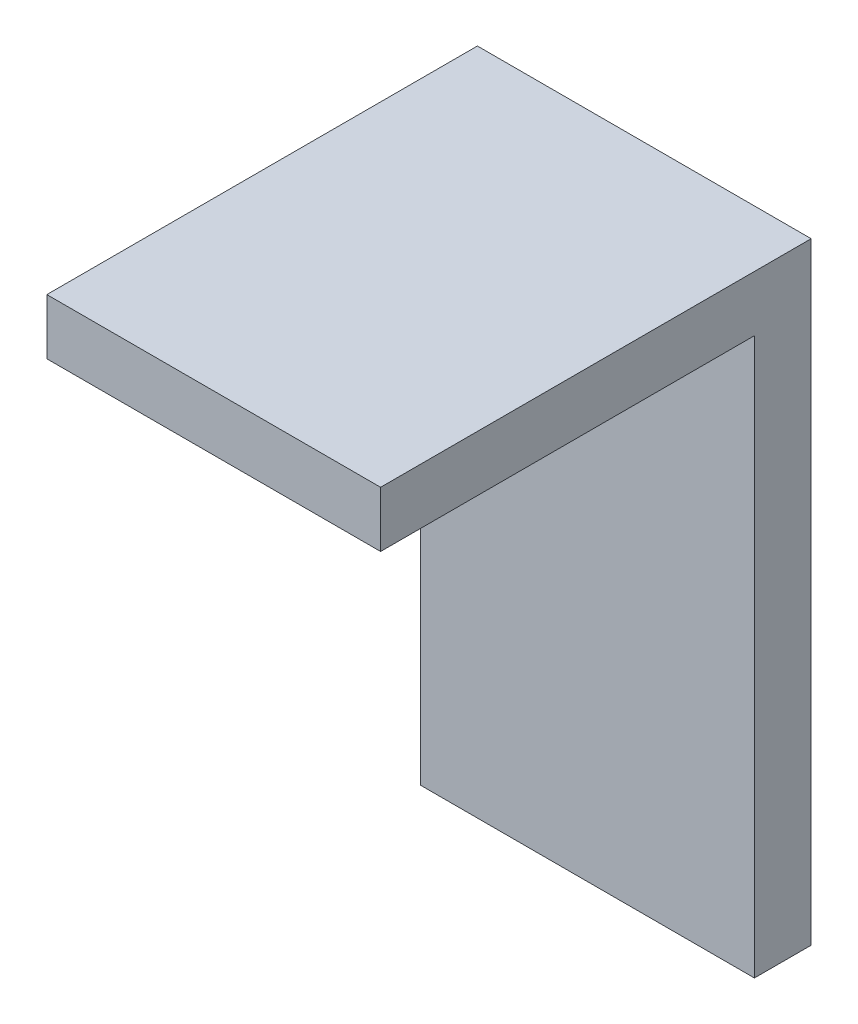
ISO-10303-21;
HEADER;
FILE_DESCRIPTION(('STEP AP214'),'2;1');
FILE_NAME('part.step','',(''),(''),'','','');
FILE_SCHEMA(('AUTOMOTIVE_DESIGN { 1 0 10303 214 1 1 1 1 }'));
ENDSEC;
DATA;
#1=APPLICATION_CONTEXT('core data for automotive mechanical design processes');
#2=APPLICATION_PROTOCOL_DEFINITION('international standard','automotive_design',2000,#1);
#3=PRODUCT_CONTEXT('',#1,'mechanical');
#4=PRODUCT('Part','Part','',(#3));
#5=PRODUCT_RELATED_PRODUCT_CATEGORY('part','',(#4));
#6=PRODUCT_DEFINITION_FORMATION('','',#4);
#7=PRODUCT_DEFINITION_CONTEXT('part definition',#1,'design');
#8=PRODUCT_DEFINITION('design','',#6,#7);
#9=PRODUCT_DEFINITION_SHAPE('','',#8);
#10=(LENGTH_UNIT() NAMED_UNIT(*) SI_UNIT(.MILLI.,.METRE.));
#11=(NAMED_UNIT(*) PLANE_ANGLE_UNIT() SI_UNIT($,.RADIAN.));
#12=(NAMED_UNIT(*) SI_UNIT($,.STERADIAN.) SOLID_ANGLE_UNIT());
#13=UNCERTAINTY_MEASURE_WITH_UNIT(LENGTH_MEASURE(1.E-05),#10,'distance_accuracy_value','');
#14=(GEOMETRIC_REPRESENTATION_CONTEXT(3) GLOBAL_UNCERTAINTY_ASSIGNED_CONTEXT((#13)) GLOBAL_UNIT_ASSIGNED_CONTEXT((#10,
#11,#12)) REPRESENTATION_CONTEXT('',''));
#15=CARTESIAN_POINT('',(0.,0.,0.));
#16=DIRECTION('',(0.,0.,1.));
#17=DIRECTION('',(1.,0.,0.));
#18=AXIS2_PLACEMENT_3D('',#15,#16,#17);
#19=CARTESIAN_POINT('',(-2.9,4.55,0.));
#20=DIRECTION('',(-1.,0.,0.));
#21=DIRECTION('',(0.,0.,1.));
#22=AXIS2_PLACEMENT_3D('',#19,#20,#21);
#23=PLANE('',#22);
#24=DIRECTION('',(0.,1.,0.));
#25=VECTOR('',#24,1.);
#26=CARTESIAN_POINT('',(-2.9,4.,0.));
#27=LINE('',#26,#25);
#28=CARTESIAN_POINT('',(-2.9,4.,0.));
#29=VERTEX_POINT('',#28);
#30=CARTESIAN_POINT('',(-2.9,4.55,0.));
#31=VERTEX_POINT('',#30);
#32=EDGE_CURVE('E11',#29,#31,#27,.T.);
#33=ORIENTED_EDGE('',*,*,#32,.F.);
#34=DIRECTION('',(0.,0.,-1.));
#35=VECTOR('',#34,1.);
#36=CARTESIAN_POINT('',(-2.9,4.,0.051));
#37=LINE('',#36,#35);
#38=CARTESIAN_POINT('',(-2.9,4.,0.051));
#39=VERTEX_POINT('',#38);
#40=EDGE_CURVE('E24',#39,#29,#37,.T.);
#41=ORIENTED_EDGE('',*,*,#40,.F.);
#42=DIRECTION('',(0.,-1.,0.));
#43=VECTOR('',#42,1.);
#44=CARTESIAN_POINT('',(-2.9,4.5,0.051));
#45=LINE('',#44,#43);
#46=CARTESIAN_POINT('',(-2.9,4.5,0.051));
#47=VERTEX_POINT('',#46);
#48=EDGE_CURVE('E87',#47,#39,#45,.T.);
#49=ORIENTED_EDGE('',*,*,#48,.F.);
#50=DIRECTION('',(0.,0.,-1.));
#51=VECTOR('',#50,1.);
#52=CARTESIAN_POINT('',(-2.9,4.5,0.387));
#53=LINE('',#52,#51);
#54=CARTESIAN_POINT('',(-2.9,4.5,0.387));
#55=VERTEX_POINT('',#54);
#56=EDGE_CURVE('E114',#55,#47,#53,.T.);
#57=ORIENTED_EDGE('',*,*,#56,.F.);
#58=DIRECTION('',(0.,-1.,0.));
#59=VECTOR('',#58,1.);
#60=CARTESIAN_POINT('',(-2.9,4.55,0.387));
#61=LINE('',#60,#59);
#62=CARTESIAN_POINT('',(-2.9,4.55,0.387));
#63=VERTEX_POINT('',#62);
#64=EDGE_CURVE('E111',#63,#55,#61,.T.);
#65=ORIENTED_EDGE('',*,*,#64,.F.);
#66=DIRECTION('',(0.,0.,1.));
#67=VECTOR('',#66,1.);
#68=CARTESIAN_POINT('',(-2.9,4.55,0.));
#69=LINE('',#68,#67);
#70=EDGE_CURVE('E108',#31,#63,#69,.T.);
#71=ORIENTED_EDGE('',*,*,#70,.F.);
#72=EDGE_LOOP('',(#33,#41,#49,#57,#65,#71));
#73=FACE_BOUND('',#72,.T.);
#74=ADVANCED_FACE('F17',(#73),#23,.T.);
#75=CARTESIAN_POINT('',(-2.6,4.,0.));
#76=DIRECTION('',(1.,0.,0.));
#77=DIRECTION('',(0.,0.,1.));
#78=AXIS2_PLACEMENT_3D('',#75,#76,#77);
#79=PLANE('',#78);
#80=DIRECTION('',(0.,-1.,0.));
#81=VECTOR('',#80,1.);
#82=CARTESIAN_POINT('',(-2.6,4.55,0.));
#83=LINE('',#82,#81);
#84=CARTESIAN_POINT('',(-2.6,4.55,0.));
#85=VERTEX_POINT('',#84);
#86=CARTESIAN_POINT('',(-2.6,4.,0.));
#87=VERTEX_POINT('',#86);
#88=EDGE_CURVE('E106',#85,#87,#83,.T.);
#89=ORIENTED_EDGE('',*,*,#88,.F.);
#90=DIRECTION('',(0.,0.,-1.));
#91=VECTOR('',#90,1.);
#92=CARTESIAN_POINT('',(-2.6,4.55,0.387));
#93=LINE('',#92,#91);
#94=CARTESIAN_POINT('',(-2.6,4.55,0.387));
#95=VERTEX_POINT('',#94);
#96=EDGE_CURVE('E103',#95,#85,#93,.T.);
#97=ORIENTED_EDGE('',*,*,#96,.F.);
#98=DIRECTION('',(0.,1.,0.));
#99=VECTOR('',#98,1.);
#100=CARTESIAN_POINT('',(-2.6,4.5,0.387));
#101=LINE('',#100,#99);
#102=CARTESIAN_POINT('',(-2.6,4.5,0.387));
#103=VERTEX_POINT('',#102);
#104=EDGE_CURVE('E100',#103,#95,#101,.T.);
#105=ORIENTED_EDGE('',*,*,#104,.F.);
#106=DIRECTION('',(0.,0.,1.));
#107=VECTOR('',#106,1.);
#108=CARTESIAN_POINT('',(-2.6,4.5,0.051));
#109=LINE('',#108,#107);
#110=CARTESIAN_POINT('',(-2.6,4.5,0.051));
#111=VERTEX_POINT('',#110);
#112=EDGE_CURVE('E72',#111,#103,#109,.T.);
#113=ORIENTED_EDGE('',*,*,#112,.F.);
#114=DIRECTION('',(0.,1.,0.));
#115=VECTOR('',#114,1.);
#116=CARTESIAN_POINT('',(-2.6,4.,0.051));
#117=LINE('',#116,#115);
#118=CARTESIAN_POINT('',(-2.6,4.,0.051));
#119=VERTEX_POINT('',#118);
#120=EDGE_CURVE('E66',#119,#111,#117,.T.);
#121=ORIENTED_EDGE('',*,*,#120,.F.);
#122=DIRECTION('',(0.,0.,1.));
#123=VECTOR('',#122,1.);
#124=CARTESIAN_POINT('',(-2.6,4.,0.));
#125=LINE('',#124,#123);
#126=EDGE_CURVE('E69',#87,#119,#125,.T.);
#127=ORIENTED_EDGE('',*,*,#126,.F.);
#128=EDGE_LOOP('',(#89,#97,#105,#113,#121,#127));
#129=FACE_BOUND('',#128,.T.);
#130=ADVANCED_FACE('F68',(#129),#79,.T.);
#131=CARTESIAN_POINT('',(-2.9,4.55,0.387));
#132=DIRECTION('',(0.,0.,1.));
#133=DIRECTION('',(0.,1.,0.));
#134=AXIS2_PLACEMENT_3D('',#131,#132,#133);
#135=PLANE('',#134);
#136=ORIENTED_EDGE('',*,*,#64,.T.);
#137=DIRECTION('',(-1.,0.,0.));
#138=VECTOR('',#137,1.);
#139=CARTESIAN_POINT('',(-2.6,4.5,0.387));
#140=LINE('',#139,#138);
#141=EDGE_CURVE('E83',#103,#55,#140,.T.);
#142=ORIENTED_EDGE('',*,*,#141,.F.);
#143=ORIENTED_EDGE('',*,*,#104,.T.);
#144=DIRECTION('',(1.,0.,0.));
#145=VECTOR('',#144,1.);
#146=CARTESIAN_POINT('',(-2.9,4.55,0.387));
#147=LINE('',#146,#145);
#148=EDGE_CURVE('E88',#63,#95,#147,.T.);
#149=ORIENTED_EDGE('',*,*,#148,.F.);
#150=EDGE_LOOP('',(#136,#142,#143,#149));
#151=FACE_BOUND('',#150,.T.);
#152=ADVANCED_FACE('F125',(#151),#135,.T.);
#153=CARTESIAN_POINT('',(-2.9,4.5,0.051));
#154=DIRECTION('',(0.,0.,1.));
#155=DIRECTION('',(0.,1.,0.));
#156=AXIS2_PLACEMENT_3D('',#153,#154,#155);
#157=PLANE('',#156);
#158=ORIENTED_EDGE('',*,*,#48,.T.);
#159=DIRECTION('',(-1.,0.,0.));
#160=VECTOR('',#159,1.);
#161=CARTESIAN_POINT('',(-2.6,4.,0.051));
#162=LINE('',#161,#160);
#163=EDGE_CURVE('E81',#119,#39,#162,.T.);
#164=ORIENTED_EDGE('',*,*,#163,.F.);
#165=ORIENTED_EDGE('',*,*,#120,.T.);
#166=DIRECTION('',(1.,0.,0.));
#167=VECTOR('',#166,1.);
#168=CARTESIAN_POINT('',(-2.9,4.5,0.051));
#169=LINE('',#168,#167);
#170=EDGE_CURVE('E89',#47,#111,#169,.T.);
#171=ORIENTED_EDGE('',*,*,#170,.F.);
#172=EDGE_LOOP('',(#158,#164,#165,#171));
#173=FACE_BOUND('',#172,.T.);
#174=ADVANCED_FACE('F86',(#173),#157,.T.);
#175=CARTESIAN_POINT('',(-2.6,4.55,0.));
#176=DIRECTION('',(0.,1.,0.));
#177=DIRECTION('',(0.,0.,1.));
#178=AXIS2_PLACEMENT_3D('',#175,#176,#177);
#179=PLANE('',#178);
#180=DIRECTION('',(1.,0.,0.));
#181=VECTOR('',#180,1.);
#182=CARTESIAN_POINT('',(-2.9,4.55,0.));
#183=LINE('',#182,#181);
#184=EDGE_CURVE('E93',#31,#85,#183,.T.);
#185=ORIENTED_EDGE('',*,*,#184,.F.);
#186=ORIENTED_EDGE('',*,*,#70,.T.);
#187=ORIENTED_EDGE('',*,*,#148,.T.);
#188=ORIENTED_EDGE('',*,*,#96,.T.);
#189=EDGE_LOOP('',(#185,#186,#187,#188));
#190=FACE_BOUND('',#189,.T.);
#191=ADVANCED_FACE('F121',(#190),#179,.T.);
#192=CARTESIAN_POINT('',(-2.9,4.,0.));
#193=DIRECTION('',(0.,-1.,0.));
#194=DIRECTION('',(0.,0.,1.));
#195=AXIS2_PLACEMENT_3D('',#192,#193,#194);
#196=PLANE('',#195);
#197=DIRECTION('',(-1.,0.,0.));
#198=VECTOR('',#197,1.);
#199=CARTESIAN_POINT('',(-2.6,4.,0.));
#200=LINE('',#199,#198);
#201=EDGE_CURVE('E82',#87,#29,#200,.T.);
#202=ORIENTED_EDGE('',*,*,#201,.F.);
#203=ORIENTED_EDGE('',*,*,#126,.T.);
#204=ORIENTED_EDGE('',*,*,#163,.T.);
#205=ORIENTED_EDGE('',*,*,#40,.T.);
#206=EDGE_LOOP('',(#202,#203,#204,#205));
#207=FACE_BOUND('',#206,.T.);
#208=ADVANCED_FACE('F80',(#207),#196,.T.);
#209=CARTESIAN_POINT('',(-2.9,4.5,0.051));
#210=DIRECTION('',(0.,-1.,0.));
#211=DIRECTION('',(0.,0.,1.));
#212=AXIS2_PLACEMENT_3D('',#209,#210,#211);
#213=PLANE('',#212);
#214=ORIENTED_EDGE('',*,*,#170,.T.);
#215=ORIENTED_EDGE('',*,*,#112,.T.);
#216=ORIENTED_EDGE('',*,*,#141,.T.);
#217=ORIENTED_EDGE('',*,*,#56,.T.);
#218=EDGE_LOOP('',(#214,#215,#216,#217));
#219=FACE_BOUND('',#218,.T.);
#220=ADVANCED_FACE('F127',(#219),#213,.T.);
#221=CARTESIAN_POINT('',(-2.6,4.55,0.));
#222=DIRECTION('',(0.,0.,-1.));
#223=DIRECTION('',(0.,1.,0.));
#224=AXIS2_PLACEMENT_3D('',#221,#222,#223);
#225=PLANE('',#224);
#226=ORIENTED_EDGE('',*,*,#88,.T.);
#227=ORIENTED_EDGE('',*,*,#201,.T.);
#228=ORIENTED_EDGE('',*,*,#32,.T.);
#229=ORIENTED_EDGE('',*,*,#184,.T.);
#230=EDGE_LOOP('',(#226,#227,#228,#229));
#231=FACE_BOUND('',#230,.T.);
#232=ADVANCED_FACE('F117',(#231),#225,.T.);
#233=CLOSED_SHELL('',(#74,#130,#152,#174,#191,#208,#220,#232));
#234=MANIFOLD_SOLID_BREP('B1',#233);
#235=ADVANCED_BREP_SHAPE_REPRESENTATION('',(#18,#234),#14);
#236=SHAPE_DEFINITION_REPRESENTATION(#9,#235);
ENDSEC;
END-ISO-10303-21;
